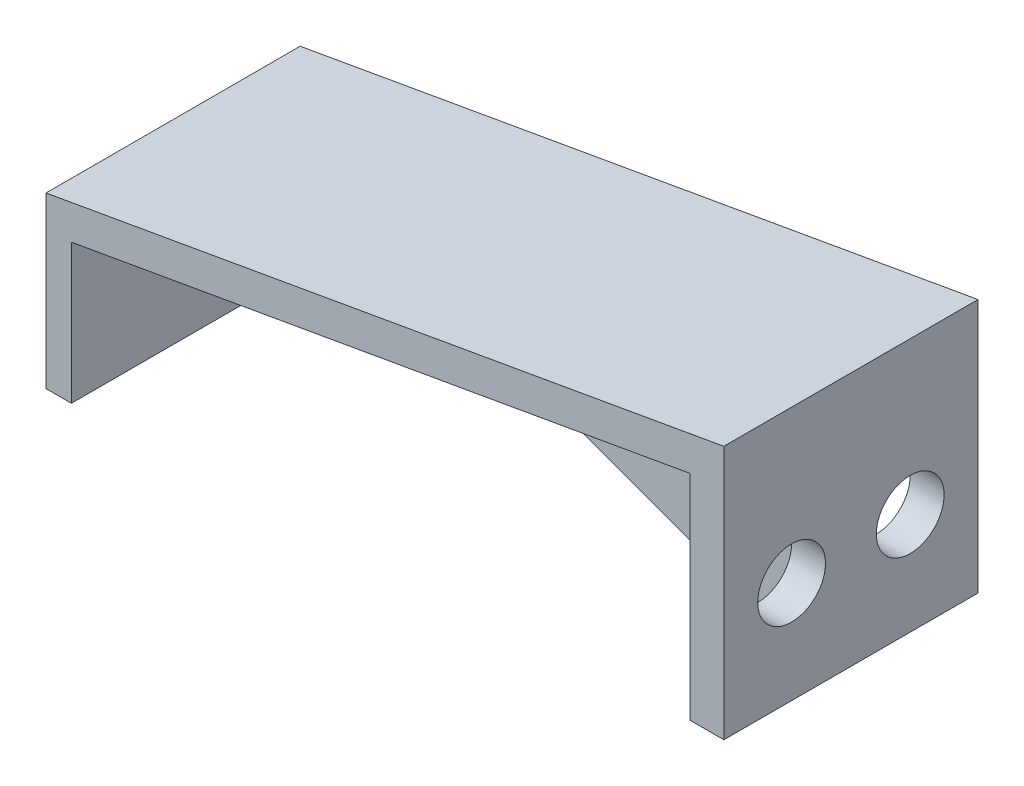
ISO-10303-21;
HEADER;
FILE_DESCRIPTION(('STEP AP214'),'2;1');
FILE_NAME('part.step','',(''),(''),'','','');
FILE_SCHEMA(('AUTOMOTIVE_DESIGN { 1 0 10303 214 1 1 1 1 }'));
ENDSEC;
DATA;
#1=APPLICATION_CONTEXT('core data for automotive mechanical design processes');
#2=APPLICATION_PROTOCOL_DEFINITION('international standard','automotive_design',2000,#1);
#3=PRODUCT_CONTEXT('',#1,'mechanical');
#4=PRODUCT('Part','Part','',(#3));
#5=PRODUCT_RELATED_PRODUCT_CATEGORY('part','',(#4));
#6=PRODUCT_DEFINITION_FORMATION('','',#4);
#7=PRODUCT_DEFINITION_CONTEXT('part definition',#1,'design');
#8=PRODUCT_DEFINITION('design','',#6,#7);
#9=PRODUCT_DEFINITION_SHAPE('','',#8);
#10=(LENGTH_UNIT() NAMED_UNIT(*) SI_UNIT(.MILLI.,.METRE.));
#11=(NAMED_UNIT(*) PLANE_ANGLE_UNIT() SI_UNIT($,.RADIAN.));
#12=(NAMED_UNIT(*) SI_UNIT($,.STERADIAN.) SOLID_ANGLE_UNIT());
#13=UNCERTAINTY_MEASURE_WITH_UNIT(LENGTH_MEASURE(1.E-05),#10,'distance_accuracy_value','');
#14=(GEOMETRIC_REPRESENTATION_CONTEXT(3) GLOBAL_UNCERTAINTY_ASSIGNED_CONTEXT((#13)) GLOBAL_UNIT_ASSIGNED_CONTEXT((#10,
#11,#12)) REPRESENTATION_CONTEXT('',''));
#15=CARTESIAN_POINT('',(0.,0.,0.));
#16=DIRECTION('',(0.,0.,1.));
#17=DIRECTION('',(1.,0.,0.));
#18=AXIS2_PLACEMENT_3D('',#15,#16,#17);
#19=CARTESIAN_POINT('',(38.,2.05307922833879,15.));
#20=DIRECTION('',(1.,0.,0.));
#21=DIRECTION('',(0.,0.,-1.));
#22=AXIS2_PLACEMENT_3D('',#19,#20,#21);
#23=PLANE('',#22);
#24=CARTESIAN_POINT('',(38.,8.06930389894761,11.));
#25=DIRECTION('',(1.,0.,0.));
#26=DIRECTION('',(0.,0.,1.));
#27=AXIS2_PLACEMENT_3D('',#24,#25,#26);
#28=CIRCLE('',#27,2.);
#29=CARTESIAN_POINT('',(38.,8.06930389894761,13.));
#30=VERTEX_POINT('',#29);
#31=EDGE_CURVE('E237',#30,#30,#28,.T.);
#32=ORIENTED_EDGE('',*,*,#31,.T.);
#33=EDGE_LOOP('',(#32));
#34=FACE_BOUND('',#33,.T.);
#35=DIRECTION('',(0.,-1.,0.));
#36=VECTOR('',#35,1.);
#37=CARTESIAN_POINT('',(38.,14.6695720431504,8.25));
#38=LINE('',#37,#36);
#39=CARTESIAN_POINT('',(38.,14.6695720431504,8.25));
#40=VERTEX_POINT('',#39);
#41=CARTESIAN_POINT('',(38.,2.05307922833879,8.25));
#42=VERTEX_POINT('',#41);
#43=EDGE_CURVE('E213',#40,#42,#38,.T.);
#44=ORIENTED_EDGE('',*,*,#43,.T.);
#45=DIRECTION('',(0.,0.,-1.));
#46=VECTOR('',#45,1.);
#47=CARTESIAN_POINT('',(38.,2.05307922833879,15.));
#48=LINE('',#47,#46);
#49=CARTESIAN_POINT('',(38.,2.05307922833879,15.));
#50=VERTEX_POINT('',#49);
#51=EDGE_CURVE('E165',#50,#42,#48,.T.);
#52=ORIENTED_EDGE('',*,*,#51,.F.);
#53=DIRECTION('',(0.,-1.,0.));
#54=VECTOR('',#53,1.);
#55=CARTESIAN_POINT('',(38.,2.05307922833879,15.));
#56=LINE('',#55,#54);
#57=CARTESIAN_POINT('',(38.,14.6695720431504,15.));
#58=VERTEX_POINT('',#57);
#59=EDGE_CURVE('E222',#58,#50,#56,.T.);
#60=ORIENTED_EDGE('',*,*,#59,.F.);
#61=DIRECTION('',(0.,0.,-1.));
#62=VECTOR('',#61,1.);
#63=CARTESIAN_POINT('',(38.,14.6695720431504,15.));
#64=LINE('',#63,#62);
#65=EDGE_CURVE('E169',#58,#40,#64,.T.);
#66=ORIENTED_EDGE('',*,*,#65,.T.);
#67=EDGE_LOOP('',(#44,#52,#60,#66));
#68=FACE_BOUND('',#67,.T.);
#69=ADVANCED_FACE('F33',(#34,#68),#23,.F.);
#70=CARTESIAN_POINT('',(1.5,0.,15.));
#71=DIRECTION('',(0.,1.,0.));
#72=DIRECTION('',(0.,0.,1.));
#73=AXIS2_PLACEMENT_3D('',#70,#71,#72);
#74=PLANE('',#73);
#75=DIRECTION('',(1.,0.,0.));
#76=VECTOR('',#75,1.);
#77=CARTESIAN_POINT('',(1.5,0.,0.));
#78=LINE('',#77,#76);
#79=CARTESIAN_POINT('',(0.,0.,0.));
#80=VERTEX_POINT('',#79);
#81=CARTESIAN_POINT('',(1.5,0.,0.));
#82=VERTEX_POINT('',#81);
#83=EDGE_CURVE('E142',#80,#82,#78,.T.);
#84=ORIENTED_EDGE('',*,*,#83,.T.);
#85=DIRECTION('',(0.,0.,-1.));
#86=VECTOR('',#85,1.);
#87=CARTESIAN_POINT('',(1.5,0.,15.));
#88=LINE('',#87,#86);
#89=CARTESIAN_POINT('',(1.5,0.,15.));
#90=VERTEX_POINT('',#89);
#91=EDGE_CURVE('E11',#90,#82,#88,.T.);
#92=ORIENTED_EDGE('',*,*,#91,.F.);
#93=DIRECTION('',(1.,0.,0.));
#94=VECTOR('',#93,1.);
#95=CARTESIAN_POINT('',(1.5,0.,15.));
#96=LINE('',#95,#94);
#97=CARTESIAN_POINT('',(0.,0.,15.));
#98=VERTEX_POINT('',#97);
#99=EDGE_CURVE('E160',#98,#90,#96,.T.);
#100=ORIENTED_EDGE('',*,*,#99,.F.);
#101=DIRECTION('',(0.,0.,-1.));
#102=VECTOR('',#101,1.);
#103=CARTESIAN_POINT('',(0.,0.,15.));
#104=LINE('',#103,#102);
#105=EDGE_CURVE('E138',#98,#80,#104,.T.);
#106=ORIENTED_EDGE('',*,*,#105,.T.);
#107=EDGE_LOOP('',(#84,#92,#100,#106));
#108=FACE_BOUND('',#107,.T.);
#109=ADVANCED_FACE('F35',(#108),#74,.F.);
#110=CARTESIAN_POINT('',(1.5,8.23363724729122,15.));
#111=DIRECTION('',(-1.,0.,0.));
#112=DIRECTION('',(0.,-1.,0.));
#113=AXIS2_PLACEMENT_3D('',#110,#111,#112);
#114=PLANE('',#113);
#115=CARTESIAN_POINT('',(1.5,5.,7.5));
#116=DIRECTION('',(-1.,0.,0.));
#117=DIRECTION('',(0.,0.,1.));
#118=AXIS2_PLACEMENT_3D('',#115,#116,#117);
#119=CIRCLE('',#118,2.);
#120=CARTESIAN_POINT('',(1.5,5.,9.5));
#121=VERTEX_POINT('',#120);
#122=EDGE_CURVE('E238',#121,#121,#119,.T.);
#123=ORIENTED_EDGE('',*,*,#122,.T.);
#124=EDGE_LOOP('',(#123));
#125=FACE_BOUND('',#124,.T.);
#126=DIRECTION('',(0.,1.,0.));
#127=VECTOR('',#126,1.);
#128=CARTESIAN_POINT('',(1.5,8.23363724729122,0.));
#129=LINE('',#128,#127);
#130=CARTESIAN_POINT('',(1.5,8.23363724729122,0.));
#131=VERTEX_POINT('',#130);
#132=EDGE_CURVE('E145',#82,#131,#129,.T.);
#133=ORIENTED_EDGE('',*,*,#132,.T.);
#134=DIRECTION('',(0.,0.,-1.));
#135=VECTOR('',#134,1.);
#136=CARTESIAN_POINT('',(1.5,8.23363724729122,15.));
#137=LINE('',#136,#135);
#138=CARTESIAN_POINT('',(1.5,8.23363724729122,15.));
#139=VERTEX_POINT('',#138);
#140=EDGE_CURVE('E41',#139,#131,#137,.T.);
#141=ORIENTED_EDGE('',*,*,#140,.F.);
#142=DIRECTION('',(0.,1.,0.));
#143=VECTOR('',#142,1.);
#144=CARTESIAN_POINT('',(1.5,8.23363724729122,15.));
#145=LINE('',#144,#143);
#146=EDGE_CURVE('E98',#90,#139,#145,.T.);
#147=ORIENTED_EDGE('',*,*,#146,.F.);
#148=ORIENTED_EDGE('',*,*,#91,.T.);
#149=EDGE_LOOP('',(#133,#141,#147,#148));
#150=FACE_BOUND('',#149,.T.);
#151=ADVANCED_FACE('F252',(#125,#150),#114,.F.);
#152=CARTESIAN_POINT('',(38.,14.6695720431504,15.));
#153=DIRECTION('',(-0.173648177666935,0.984807753012207,0.));
#154=DIRECTION('',(-0.984807753012207,-0.173648177666935,0.));
#155=AXIS2_PLACEMENT_3D('',#152,#153,#154);
#156=PLANE('',#155);
#157=CARTESIAN_POINT('',(38.,14.6695720431504,6.75));
#158=VERTEX_POINT('',#157);
#159=CARTESIAN_POINT('',(38.,14.6695720431504,0.));
#160=VERTEX_POINT('',#159);
#161=EDGE_CURVE('E168',#158,#160,#64,.T.);
#162=ORIENTED_EDGE('',*,*,#161,.F.);
#163=DIRECTION('',(0.984807753012207,0.173648177666935,0.));
#164=VECTOR('',#163,1.);
#165=CARTESIAN_POINT('',(14.6489767758605,10.5521566215845,6.75));
#166=LINE('',#165,#164);
#167=CARTESIAN_POINT('',(14.6489767758605,10.5521566215845,6.75));
#168=VERTEX_POINT('',#167);
#169=EDGE_CURVE('E194',#168,#158,#166,.T.);
#170=ORIENTED_EDGE('',*,*,#169,.F.);
#171=DIRECTION('',(0.,0.,1.));
#172=VECTOR('',#171,1.);
#173=CARTESIAN_POINT('',(14.6489767758605,10.5521566215845,6.75));
#174=LINE('',#173,#172);
#175=CARTESIAN_POINT('',(14.6489767758605,10.5521566215845,8.25));
#176=VERTEX_POINT('',#175);
#177=EDGE_CURVE('E208',#168,#176,#174,.T.);
#178=ORIENTED_EDGE('',*,*,#177,.T.);
#179=DIRECTION('',(0.984807753012207,0.173648177666935,0.));
#180=VECTOR('',#179,1.);
#181=CARTESIAN_POINT('',(14.6489767758605,10.5521566215845,8.25));
#182=LINE('',#181,#180);
#183=EDGE_CURVE('E215',#176,#40,#182,.T.);
#184=ORIENTED_EDGE('',*,*,#183,.T.);
#185=ORIENTED_EDGE('',*,*,#65,.F.);
#186=DIRECTION('',(0.984807753012207,0.173648177666935,0.));
#187=VECTOR('',#186,1.);
#188=CARTESIAN_POINT('',(38.,14.6695720431504,15.));
#189=LINE('',#188,#187);
#190=EDGE_CURVE('E179',#139,#58,#189,.T.);
#191=ORIENTED_EDGE('',*,*,#190,.F.);
#192=ORIENTED_EDGE('',*,*,#140,.T.);
#193=DIRECTION('',(0.984807753012207,0.173648177666935,0.));
#194=VECTOR('',#193,1.);
#195=CARTESIAN_POINT('',(38.,14.6695720431504,0.));
#196=LINE('',#195,#194);
#197=EDGE_CURVE('E148',#131,#160,#196,.T.);
#198=ORIENTED_EDGE('',*,*,#197,.T.);
#199=EDGE_LOOP('',(#162,#170,#178,#184,#185,#191,#192,#198));
#200=FACE_BOUND('',#199,.T.);
#201=ADVANCED_FACE('F176',(#200),#156,.F.);
#202=CARTESIAN_POINT('',(38.,8.06930389894761,4.));
#203=DIRECTION('',(1.,0.,0.));
#204=DIRECTION('',(0.,0.,-1.));
#205=AXIS2_PLACEMENT_3D('',#202,#203,#204);
#206=CIRCLE('',#205,2.);
#207=CARTESIAN_POINT('',(38.,8.06930389894761,2.));
#208=VERTEX_POINT('',#207);
#209=EDGE_CURVE('E230',#208,#208,#206,.T.);
#210=ORIENTED_EDGE('',*,*,#209,.T.);
#211=EDGE_LOOP('',(#210));
#212=FACE_BOUND('',#211,.T.);
#213=CARTESIAN_POINT('',(38.,2.05307922833879,6.75));
#214=VERTEX_POINT('',#213);
#215=CARTESIAN_POINT('',(38.,2.05307922833879,0.));
#216=VERTEX_POINT('',#215);
#217=EDGE_CURVE('E164',#214,#216,#48,.T.);
#218=ORIENTED_EDGE('',*,*,#217,.F.);
#219=DIRECTION('',(0.,-1.,0.));
#220=VECTOR('',#219,1.);
#221=CARTESIAN_POINT('',(38.,14.6695720431504,6.75));
#222=LINE('',#221,#220);
#223=EDGE_CURVE('E190',#158,#214,#222,.T.);
#224=ORIENTED_EDGE('',*,*,#223,.F.);
#225=ORIENTED_EDGE('',*,*,#161,.T.);
#226=DIRECTION('',(0.,-1.,0.));
#227=VECTOR('',#226,1.);
#228=CARTESIAN_POINT('',(38.,2.05307922833879,0.));
#229=LINE('',#228,#227);
#230=EDGE_CURVE('E151',#160,#216,#229,.T.);
#231=ORIENTED_EDGE('',*,*,#230,.T.);
#232=EDGE_LOOP('',(#218,#224,#225,#231));
#233=FACE_BOUND('',#232,.T.);
#234=ADVANCED_FACE('F186',(#212,#233),#23,.F.);
#235=CARTESIAN_POINT('',(40.,2.05307922833879,15.));
#236=DIRECTION('',(0.,1.,0.));
#237=DIRECTION('',(-1.,0.,0.));
#238=AXIS2_PLACEMENT_3D('',#235,#236,#237);
#239=PLANE('',#238);
#240=DIRECTION('',(1.,0.,0.));
#241=VECTOR('',#240,1.);
#242=CARTESIAN_POINT('',(40.,2.05307922833879,0.));
#243=LINE('',#242,#241);
#244=CARTESIAN_POINT('',(40.,2.05307922833879,0.));
#245=VERTEX_POINT('',#244);
#246=EDGE_CURVE('E154',#216,#245,#243,.T.);
#247=ORIENTED_EDGE('',*,*,#246,.T.);
#248=DIRECTION('',(0.,0.,-1.));
#249=VECTOR('',#248,1.);
#250=CARTESIAN_POINT('',(40.,2.05307922833879,15.));
#251=LINE('',#250,#249);
#252=CARTESIAN_POINT('',(40.,2.05307922833879,15.));
#253=VERTEX_POINT('',#252);
#254=EDGE_CURVE('E133',#253,#245,#251,.T.);
#255=ORIENTED_EDGE('',*,*,#254,.F.);
#256=DIRECTION('',(1.,0.,0.));
#257=VECTOR('',#256,1.);
#258=CARTESIAN_POINT('',(40.,2.05307922833879,15.));
#259=LINE('',#258,#257);
#260=EDGE_CURVE('E121',#50,#253,#259,.T.);
#261=ORIENTED_EDGE('',*,*,#260,.F.);
#262=ORIENTED_EDGE('',*,*,#51,.T.);
#263=DIRECTION('',(0.,0.,1.));
#264=VECTOR('',#263,1.);
#265=CARTESIAN_POINT('',(38.,2.05307922833879,6.75));
#266=LINE('',#265,#264);
#267=EDGE_CURVE('E146',#214,#42,#266,.T.);
#268=ORIENTED_EDGE('',*,*,#267,.F.);
#269=ORIENTED_EDGE('',*,*,#217,.T.);
#270=EDGE_LOOP('',(#247,#255,#261,#262,#268,#269));
#271=FACE_BOUND('',#270,.T.);
#272=ADVANCED_FACE('F221',(#271),#239,.F.);
#273=CARTESIAN_POINT('',(40.,17.0530792283388,15.));
#274=DIRECTION('',(-1.,0.,0.));
#275=DIRECTION('',(0.,0.,1.));
#276=AXIS2_PLACEMENT_3D('',#273,#274,#275);
#277=PLANE('',#276);
#278=CARTESIAN_POINT('',(40.,8.06930389894761,4.));
#279=DIRECTION('',(1.,0.,0.));
#280=DIRECTION('',(0.,0.,-1.));
#281=AXIS2_PLACEMENT_3D('',#278,#279,#280);
#282=CIRCLE('',#281,2.);
#283=CARTESIAN_POINT('',(40.,8.06930389894761,2.));
#284=VERTEX_POINT('',#283);
#285=EDGE_CURVE('E241',#284,#284,#282,.T.);
#286=ORIENTED_EDGE('',*,*,#285,.F.);
#287=EDGE_LOOP('',(#286));
#288=FACE_BOUND('',#287,.T.);
#289=CARTESIAN_POINT('',(40.,8.06930389894761,11.));
#290=DIRECTION('',(1.,0.,0.));
#291=DIRECTION('',(0.,0.,1.));
#292=AXIS2_PLACEMENT_3D('',#289,#290,#291);
#293=CIRCLE('',#292,2.);
#294=CARTESIAN_POINT('',(40.,8.06930389894761,13.));
#295=VERTEX_POINT('',#294);
#296=EDGE_CURVE('E234',#295,#295,#293,.T.);
#297=ORIENTED_EDGE('',*,*,#296,.F.);
#298=EDGE_LOOP('',(#297));
#299=FACE_BOUND('',#298,.T.);
#300=DIRECTION('',(0.,1.,0.));
#301=VECTOR('',#300,1.);
#302=CARTESIAN_POINT('',(40.,17.0530792283388,0.));
#303=LINE('',#302,#301);
#304=CARTESIAN_POINT('',(40.,17.0530792283388,0.));
#305=VERTEX_POINT('',#304);
#306=EDGE_CURVE('E130',#245,#305,#303,.T.);
#307=ORIENTED_EDGE('',*,*,#306,.T.);
#308=DIRECTION('',(0.,0.,-1.));
#309=VECTOR('',#308,1.);
#310=CARTESIAN_POINT('',(40.,17.0530792283388,15.));
#311=LINE('',#310,#309);
#312=CARTESIAN_POINT('',(40.,17.0530792283388,15.));
#313=VERTEX_POINT('',#312);
#314=EDGE_CURVE('E127',#313,#305,#311,.T.);
#315=ORIENTED_EDGE('',*,*,#314,.F.);
#316=DIRECTION('',(0.,1.,0.));
#317=VECTOR('',#316,1.);
#318=CARTESIAN_POINT('',(40.,17.0530792283388,15.));
#319=LINE('',#318,#317);
#320=EDGE_CURVE('E114',#253,#313,#319,.T.);
#321=ORIENTED_EDGE('',*,*,#320,.F.);
#322=ORIENTED_EDGE('',*,*,#254,.T.);
#323=EDGE_LOOP('',(#307,#315,#321,#322));
#324=FACE_BOUND('',#323,.T.);
#325=ADVANCED_FACE('F128',(#288,#299,#324),#277,.F.);
#326=CARTESIAN_POINT('',(0.,10.,15.));
#327=DIRECTION('',(0.173648177666935,-0.984807753012207,0.));
#328=DIRECTION('',(0.984807753012207,0.173648177666935,0.));
#329=AXIS2_PLACEMENT_3D('',#326,#327,#328);
#330=PLANE('',#329);
#331=DIRECTION('',(-0.984807753012207,-0.173648177666935,0.));
#332=VECTOR('',#331,1.);
#333=CARTESIAN_POINT('',(0.,10.,0.));
#334=LINE('',#333,#332);
#335=CARTESIAN_POINT('',(0.,10.,0.));
#336=VERTEX_POINT('',#335);
#337=EDGE_CURVE('E157',#305,#336,#334,.T.);
#338=ORIENTED_EDGE('',*,*,#337,.T.);
#339=DIRECTION('',(0.,0.,-1.));
#340=VECTOR('',#339,1.);
#341=CARTESIAN_POINT('',(0.,10.,15.));
#342=LINE('',#341,#340);
#343=CARTESIAN_POINT('',(0.,10.,15.));
#344=VERTEX_POINT('',#343);
#345=EDGE_CURVE('E134',#344,#336,#342,.T.);
#346=ORIENTED_EDGE('',*,*,#345,.F.);
#347=DIRECTION('',(-0.984807753012207,-0.173648177666935,0.));
#348=VECTOR('',#347,1.);
#349=CARTESIAN_POINT('',(0.,10.,15.));
#350=LINE('',#349,#348);
#351=EDGE_CURVE('E118',#313,#344,#350,.T.);
#352=ORIENTED_EDGE('',*,*,#351,.F.);
#353=ORIENTED_EDGE('',*,*,#314,.T.);
#354=EDGE_LOOP('',(#338,#346,#352,#353));
#355=FACE_BOUND('',#354,.T.);
#356=ADVANCED_FACE('F136',(#355),#330,.F.);
#357=CARTESIAN_POINT('',(0.,0.,15.));
#358=DIRECTION('',(1.,0.,0.));
#359=DIRECTION('',(0.,0.,-1.));
#360=AXIS2_PLACEMENT_3D('',#357,#358,#359);
#361=PLANE('',#360);
#362=CARTESIAN_POINT('',(0.,5.,7.5));
#363=DIRECTION('',(-1.,0.,0.));
#364=DIRECTION('',(0.,0.,1.));
#365=AXIS2_PLACEMENT_3D('',#362,#363,#364);
#366=CIRCLE('',#365,2.);
#367=CARTESIAN_POINT('',(0.,5.,9.5));
#368=VERTEX_POINT('',#367);
#369=EDGE_CURVE('E246',#368,#368,#366,.T.);
#370=ORIENTED_EDGE('',*,*,#369,.F.);
#371=EDGE_LOOP('',(#370));
#372=FACE_BOUND('',#371,.T.);
#373=DIRECTION('',(0.,-1.,0.));
#374=VECTOR('',#373,1.);
#375=CARTESIAN_POINT('',(0.,0.,0.));
#376=LINE('',#375,#374);
#377=EDGE_CURVE('E90',#336,#80,#376,.T.);
#378=ORIENTED_EDGE('',*,*,#377,.T.);
#379=ORIENTED_EDGE('',*,*,#105,.F.);
#380=DIRECTION('',(0.,-1.,0.));
#381=VECTOR('',#380,1.);
#382=CARTESIAN_POINT('',(0.,0.,15.));
#383=LINE('',#382,#381);
#384=EDGE_CURVE('E57',#344,#98,#383,.T.);
#385=ORIENTED_EDGE('',*,*,#384,.F.);
#386=ORIENTED_EDGE('',*,*,#345,.T.);
#387=EDGE_LOOP('',(#378,#379,#385,#386));
#388=FACE_BOUND('',#387,.T.);
#389=ADVANCED_FACE('F261',(#372,#388),#361,.F.);
#390=CARTESIAN_POINT('',(0.,0.,15.));
#391=DIRECTION('',(0.,0.,-1.));
#392=DIRECTION('',(-1.,0.,0.));
#393=AXIS2_PLACEMENT_3D('',#390,#391,#392);
#394=PLANE('',#393);
#395=ORIENTED_EDGE('',*,*,#99,.T.);
#396=ORIENTED_EDGE('',*,*,#146,.T.);
#397=ORIENTED_EDGE('',*,*,#190,.T.);
#398=ORIENTED_EDGE('',*,*,#59,.T.);
#399=ORIENTED_EDGE('',*,*,#260,.T.);
#400=ORIENTED_EDGE('',*,*,#320,.T.);
#401=ORIENTED_EDGE('',*,*,#351,.T.);
#402=ORIENTED_EDGE('',*,*,#384,.T.);
#403=EDGE_LOOP('',(#395,#396,#397,#398,#399,#400,#401,#402));
#404=FACE_BOUND('',#403,.T.);
#405=ADVANCED_FACE('F116',(#404),#394,.F.);
#406=CARTESIAN_POINT('',(0.,0.,0.));
#407=DIRECTION('',(0.,0.,-1.));
#408=DIRECTION('',(-1.,0.,0.));
#409=AXIS2_PLACEMENT_3D('',#406,#407,#408);
#410=PLANE('',#409);
#411=ORIENTED_EDGE('',*,*,#83,.F.);
#412=ORIENTED_EDGE('',*,*,#377,.F.);
#413=ORIENTED_EDGE('',*,*,#337,.F.);
#414=ORIENTED_EDGE('',*,*,#306,.F.);
#415=ORIENTED_EDGE('',*,*,#246,.F.);
#416=ORIENTED_EDGE('',*,*,#230,.F.);
#417=ORIENTED_EDGE('',*,*,#197,.F.);
#418=ORIENTED_EDGE('',*,*,#132,.F.);
#419=EDGE_LOOP('',(#411,#412,#413,#414,#415,#416,#417,#418));
#420=FACE_BOUND('',#419,.T.);
#421=ADVANCED_FACE('F182',(#420),#410,.T.);
#422=CARTESIAN_POINT('',(38.,2.05307922833879,6.75));
#423=DIRECTION('',(0.342020143325673,0.939692620785907,0.));
#424=DIRECTION('',(-0.939692620785907,0.342020143325673,0.));
#425=AXIS2_PLACEMENT_3D('',#422,#423,#424);
#426=PLANE('',#425);
#427=DIRECTION('',(-0.939692620785907,0.342020143325673,0.));
#428=VECTOR('',#427,1.);
#429=CARTESIAN_POINT('',(38.,2.05307922833879,8.25));
#430=LINE('',#429,#428);
#431=EDGE_CURVE('E205',#42,#176,#430,.T.);
#432=ORIENTED_EDGE('',*,*,#431,.T.);
#433=ORIENTED_EDGE('',*,*,#177,.F.);
#434=DIRECTION('',(-0.939692620785907,0.342020143325673,0.));
#435=VECTOR('',#434,1.);
#436=CARTESIAN_POINT('',(38.,2.05307922833879,6.75));
#437=LINE('',#436,#435);
#438=EDGE_CURVE('E48',#214,#168,#437,.T.);
#439=ORIENTED_EDGE('',*,*,#438,.F.);
#440=ORIENTED_EDGE('',*,*,#267,.T.);
#441=EDGE_LOOP('',(#432,#433,#439,#440));
#442=FACE_BOUND('',#441,.T.);
#443=ADVANCED_FACE('F204',(#442),#426,.F.);
#444=CARTESIAN_POINT('',(0.,0.,6.75));
#445=DIRECTION('',(0.,0.,-1.));
#446=DIRECTION('',(-1.,0.,0.));
#447=AXIS2_PLACEMENT_3D('',#444,#445,#446);
#448=PLANE('',#447);
#449=ORIENTED_EDGE('',*,*,#169,.T.);
#450=ORIENTED_EDGE('',*,*,#223,.T.);
#451=ORIENTED_EDGE('',*,*,#438,.T.);
#452=EDGE_LOOP('',(#449,#450,#451));
#453=FACE_BOUND('',#452,.T.);
#454=ADVANCED_FACE('F305',(#453),#448,.T.);
#455=CARTESIAN_POINT('',(0.,0.,8.25));
#456=DIRECTION('',(0.,0.,-1.));
#457=DIRECTION('',(-1.,0.,0.));
#458=AXIS2_PLACEMENT_3D('',#455,#456,#457);
#459=PLANE('',#458);
#460=ORIENTED_EDGE('',*,*,#183,.F.);
#461=ORIENTED_EDGE('',*,*,#431,.F.);
#462=ORIENTED_EDGE('',*,*,#43,.F.);
#463=EDGE_LOOP('',(#460,#461,#462));
#464=FACE_BOUND('',#463,.T.);
#465=ADVANCED_FACE('F212',(#464),#459,.F.);
#466=CARTESIAN_POINT('',(38.,8.06930389894761,11.));
#467=DIRECTION('',(1.,0.,0.));
#468=DIRECTION('',(0.,0.,-1.));
#469=AXIS2_PLACEMENT_3D('',#466,#467,#468);
#470=CYLINDRICAL_SURFACE('',#469,2.);
#471=ORIENTED_EDGE('',*,*,#31,.F.);
#472=EDGE_LOOP('',(#471));
#473=FACE_BOUND('',#472,.T.);
#474=ORIENTED_EDGE('',*,*,#296,.T.);
#475=EDGE_LOOP('',(#474));
#476=FACE_BOUND('',#475,.T.);
#477=ADVANCED_FACE('F290',(#473,#476),#470,.F.);
#478=CARTESIAN_POINT('',(38.,8.06930389894761,4.));
#479=DIRECTION('',(1.,0.,0.));
#480=DIRECTION('',(0.,0.,-1.));
#481=AXIS2_PLACEMENT_3D('',#478,#479,#480);
#482=CYLINDRICAL_SURFACE('',#481,2.);
#483=ORIENTED_EDGE('',*,*,#209,.F.);
#484=EDGE_LOOP('',(#483));
#485=FACE_BOUND('',#484,.T.);
#486=ORIENTED_EDGE('',*,*,#285,.T.);
#487=EDGE_LOOP('',(#486));
#488=FACE_BOUND('',#487,.T.);
#489=ADVANCED_FACE('F257',(#485,#488),#482,.F.);
#490=CARTESIAN_POINT('',(1.5,5.,7.5));
#491=DIRECTION('',(-1.,0.,0.));
#492=DIRECTION('',(0.,0.,1.));
#493=AXIS2_PLACEMENT_3D('',#490,#491,#492);
#494=CYLINDRICAL_SURFACE('',#493,2.);
#495=ORIENTED_EDGE('',*,*,#122,.F.);
#496=EDGE_LOOP('',(#495));
#497=FACE_BOUND('',#496,.T.);
#498=ORIENTED_EDGE('',*,*,#369,.T.);
#499=EDGE_LOOP('',(#498));
#500=FACE_BOUND('',#499,.T.);
#501=ADVANCED_FACE('F254',(#497,#500),#494,.F.);
#502=CLOSED_SHELL('',(#69,#109,#151,#201,#234,#272,#325,#356,#389,#405,#421,#443,#454,#465,#477,
#489,#501));
#503=MANIFOLD_SOLID_BREP('B2',#502);
#504=ADVANCED_BREP_SHAPE_REPRESENTATION('',(#18,#503),#14);
#505=SHAPE_DEFINITION_REPRESENTATION(#9,#504);
ENDSEC;
END-ISO-10303-21;
